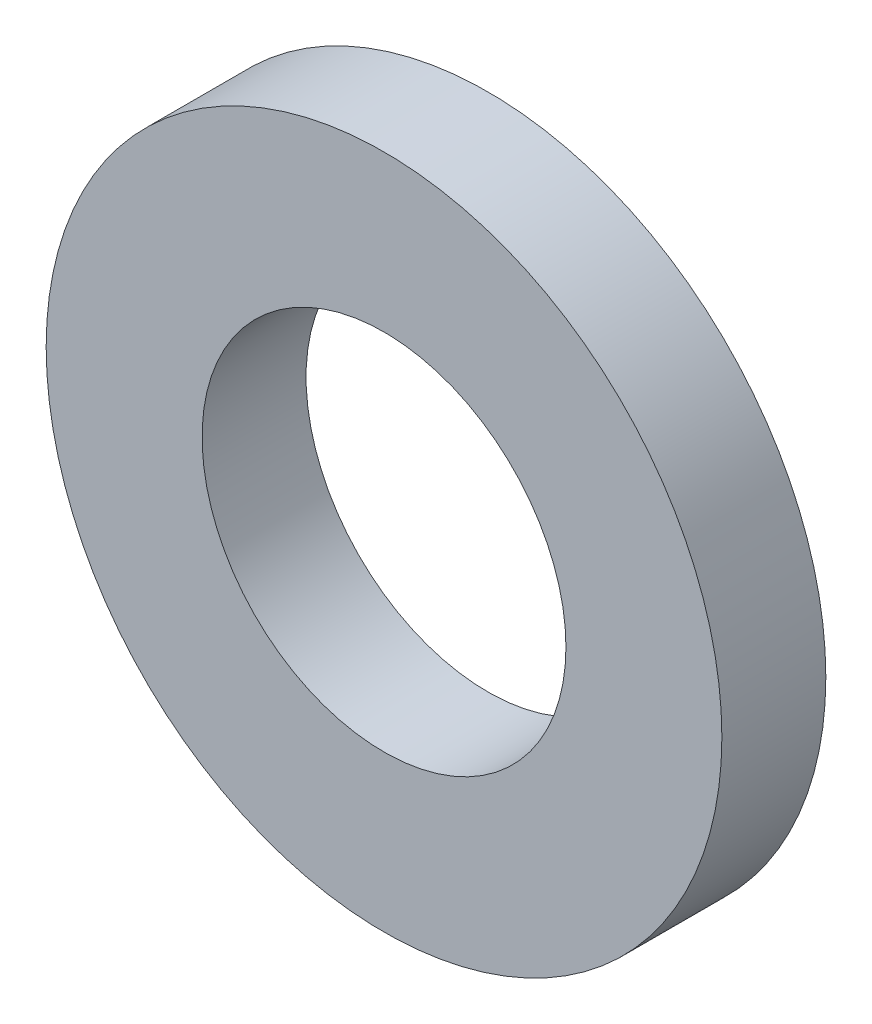
ISO-10303-21;
HEADER;
FILE_DESCRIPTION(('STEP AP214'),'2;1');
FILE_NAME('part.step','',(''),(''),'','','');
FILE_SCHEMA(('AUTOMOTIVE_DESIGN { 1 0 10303 214 1 1 1 1 }'));
ENDSEC;
DATA;
#1=APPLICATION_CONTEXT('core data for automotive mechanical design processes');
#2=APPLICATION_PROTOCOL_DEFINITION('international standard','automotive_design',2000,#1);
#3=PRODUCT_CONTEXT('',#1,'mechanical');
#4=PRODUCT('Part','Part','',(#3));
#5=PRODUCT_RELATED_PRODUCT_CATEGORY('part','',(#4));
#6=PRODUCT_DEFINITION_FORMATION('','',#4);
#7=PRODUCT_DEFINITION_CONTEXT('part definition',#1,'design');
#8=PRODUCT_DEFINITION('design','',#6,#7);
#9=PRODUCT_DEFINITION_SHAPE('','',#8);
#10=(LENGTH_UNIT() NAMED_UNIT(*) SI_UNIT(.MILLI.,.METRE.));
#11=(NAMED_UNIT(*) PLANE_ANGLE_UNIT() SI_UNIT($,.RADIAN.));
#12=(NAMED_UNIT(*) SI_UNIT($,.STERADIAN.) SOLID_ANGLE_UNIT());
#13=UNCERTAINTY_MEASURE_WITH_UNIT(LENGTH_MEASURE(1.E-05),#10,'distance_accuracy_value','');
#14=(GEOMETRIC_REPRESENTATION_CONTEXT(3) GLOBAL_UNCERTAINTY_ASSIGNED_CONTEXT((#13)) GLOBAL_UNIT_ASSIGNED_CONTEXT((#10,
#11,#12)) REPRESENTATION_CONTEXT('',''));
#15=CARTESIAN_POINT('',(0.,0.,0.));
#16=DIRECTION('',(0.,0.,1.));
#17=DIRECTION('',(1.,0.,0.));
#18=AXIS2_PLACEMENT_3D('',#15,#16,#17);
#19=CARTESIAN_POINT('',(0.,0.,4.));
#20=DIRECTION('',(0.,0.,1.));
#21=DIRECTION('',(1.,0.,0.));
#22=AXIS2_PLACEMENT_3D('',#19,#20,#21);
#23=PLANE('',#22);
#24=CARTESIAN_POINT('',(0.,0.,4.));
#25=DIRECTION('',(0.,0.,1.));
#26=DIRECTION('',(1.,0.,0.));
#27=AXIS2_PLACEMENT_3D('',#24,#25,#26);
#28=CIRCLE('',#27,13.);
#29=CARTESIAN_POINT('',(13.,0.,4.));
#30=VERTEX_POINT('',#29);
#31=EDGE_CURVE('E10',#30,#30,#28,.T.);
#32=ORIENTED_EDGE('',*,*,#31,.T.);
#33=EDGE_LOOP('',(#32));
#34=FACE_BOUND('',#33,.T.);
#35=CARTESIAN_POINT('',(0.,0.,4.));
#36=DIRECTION('',(0.,0.,1.));
#37=DIRECTION('',(1.,0.,0.));
#38=AXIS2_PLACEMENT_3D('',#35,#36,#37);
#39=CIRCLE('',#38,7.);
#40=CARTESIAN_POINT('',(7.,0.,4.));
#41=VERTEX_POINT('',#40);
#42=EDGE_CURVE('E50',#41,#41,#39,.T.);
#43=ORIENTED_EDGE('',*,*,#42,.F.);
#44=EDGE_LOOP('',(#43));
#45=FACE_BOUND('',#44,.T.);
#46=ADVANCED_FACE('F37',(#34,#45),#23,.T.);
#47=CARTESIAN_POINT('',(0.,0.,0.));
#48=DIRECTION('',(0.,0.,1.));
#49=DIRECTION('',(1.,0.,0.));
#50=AXIS2_PLACEMENT_3D('',#47,#48,#49);
#51=PLANE('',#50);
#52=CARTESIAN_POINT('',(0.,0.,0.));
#53=DIRECTION('',(0.,0.,1.));
#54=DIRECTION('',(1.,0.,0.));
#55=AXIS2_PLACEMENT_3D('',#52,#53,#54);
#56=CIRCLE('',#55,13.);
#57=CARTESIAN_POINT('',(13.,0.,0.));
#58=VERTEX_POINT('',#57);
#59=EDGE_CURVE('E41',#58,#58,#56,.T.);
#60=ORIENTED_EDGE('',*,*,#59,.F.);
#61=EDGE_LOOP('',(#60));
#62=FACE_BOUND('',#61,.T.);
#63=CARTESIAN_POINT('',(0.,0.,0.));
#64=DIRECTION('',(0.,0.,1.));
#65=DIRECTION('',(1.,0.,0.));
#66=AXIS2_PLACEMENT_3D('',#63,#64,#65);
#67=CIRCLE('',#66,7.);
#68=CARTESIAN_POINT('',(7.,0.,0.));
#69=VERTEX_POINT('',#68);
#70=EDGE_CURVE('E52',#69,#69,#67,.T.);
#71=ORIENTED_EDGE('',*,*,#70,.T.);
#72=EDGE_LOOP('',(#71));
#73=FACE_BOUND('',#72,.T.);
#74=ADVANCED_FACE('F64',(#62,#73),#51,.F.);
#75=CARTESIAN_POINT('',(0.,0.,4.));
#76=DIRECTION('',(0.,0.,-1.));
#77=DIRECTION('',(-1.,0.,0.));
#78=AXIS2_PLACEMENT_3D('',#75,#76,#77);
#79=CYLINDRICAL_SURFACE('',#78,13.);
#80=ORIENTED_EDGE('',*,*,#31,.F.);
#81=EDGE_LOOP('',(#80));
#82=FACE_BOUND('',#81,.T.);
#83=ORIENTED_EDGE('',*,*,#59,.T.);
#84=EDGE_LOOP('',(#83));
#85=FACE_BOUND('',#84,.T.);
#86=ADVANCED_FACE('F39',(#82,#85),#79,.T.);
#87=CARTESIAN_POINT('',(0.,0.,4.));
#88=DIRECTION('',(0.,0.,-1.));
#89=DIRECTION('',(-1.,0.,0.));
#90=AXIS2_PLACEMENT_3D('',#87,#88,#89);
#91=CYLINDRICAL_SURFACE('',#90,7.);
#92=ORIENTED_EDGE('',*,*,#42,.T.);
#93=EDGE_LOOP('',(#92));
#94=FACE_BOUND('',#93,.T.);
#95=ORIENTED_EDGE('',*,*,#70,.F.);
#96=EDGE_LOOP('',(#95));
#97=FACE_BOUND('',#96,.T.);
#98=ADVANCED_FACE('F60',(#94,#97),#91,.F.);
#99=CLOSED_SHELL('',(#46,#74,#86,#98));
#100=MANIFOLD_SOLID_BREP('B2',#99);
#101=ADVANCED_BREP_SHAPE_REPRESENTATION('',(#18,#100),#14);
#102=SHAPE_DEFINITION_REPRESENTATION(#9,#101);
ENDSEC;
END-ISO-10303-21;
